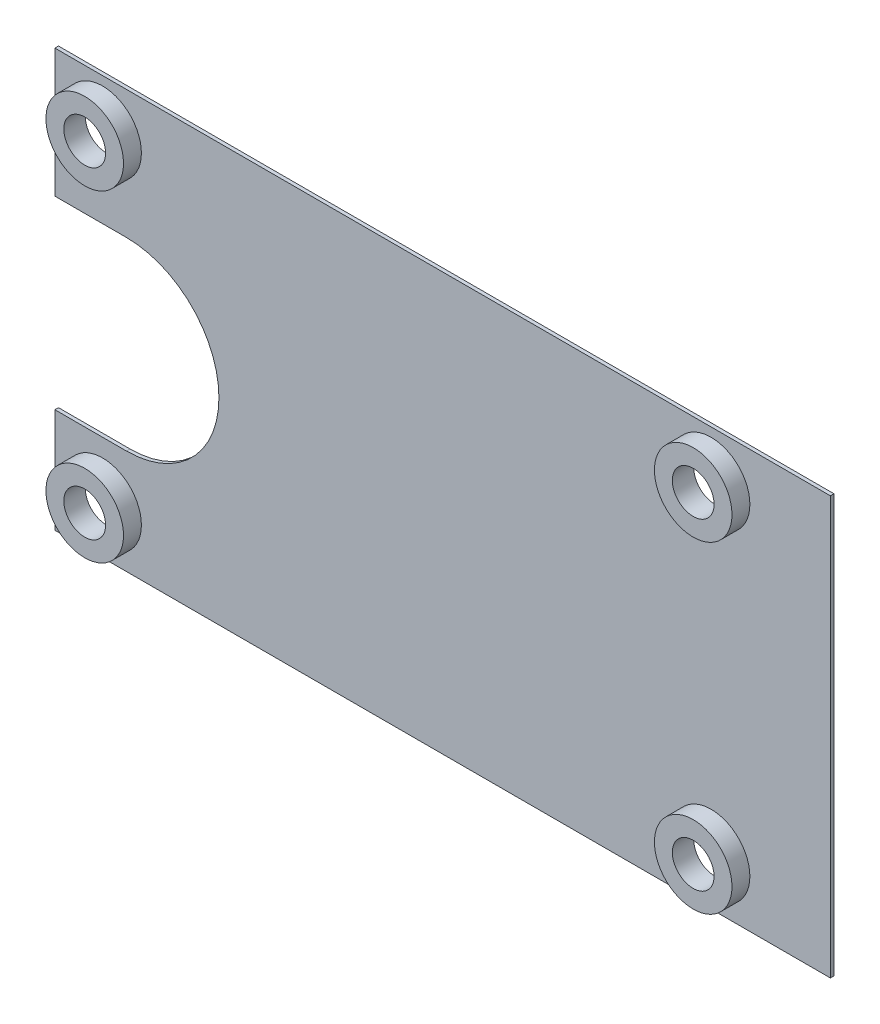
ISO-10303-21;
HEADER;
FILE_DESCRIPTION(('STEP AP214'),'2;1');
FILE_NAME('part.step','',(''),(''),'','','');
FILE_SCHEMA(('AUTOMOTIVE_DESIGN { 1 0 10303 214 1 1 1 1 }'));
ENDSEC;
DATA;
#1=APPLICATION_CONTEXT('core data for automotive mechanical design processes');
#2=APPLICATION_PROTOCOL_DEFINITION('international standard','automotive_design',2000,#1);
#3=PRODUCT_CONTEXT('',#1,'mechanical');
#4=PRODUCT('Part','Part','',(#3));
#5=PRODUCT_RELATED_PRODUCT_CATEGORY('part','',(#4));
#6=PRODUCT_DEFINITION_FORMATION('','',#4);
#7=PRODUCT_DEFINITION_CONTEXT('part definition',#1,'design');
#8=PRODUCT_DEFINITION('design','',#6,#7);
#9=PRODUCT_DEFINITION_SHAPE('','',#8);
#10=(LENGTH_UNIT() NAMED_UNIT(*) SI_UNIT(.MILLI.,.METRE.));
#11=(NAMED_UNIT(*) PLANE_ANGLE_UNIT() SI_UNIT($,.RADIAN.));
#12=(NAMED_UNIT(*) SI_UNIT($,.STERADIAN.) SOLID_ANGLE_UNIT());
#13=UNCERTAINTY_MEASURE_WITH_UNIT(LENGTH_MEASURE(1.E-05),#10,'distance_accuracy_value','');
#14=(GEOMETRIC_REPRESENTATION_CONTEXT(3) GLOBAL_UNCERTAINTY_ASSIGNED_CONTEXT((#13)) GLOBAL_UNIT_ASSIGNED_CONTEXT((#10,
#11,#12)) REPRESENTATION_CONTEXT('',''));
#15=CARTESIAN_POINT('',(0.,0.,0.));
#16=DIRECTION('',(0.,0.,1.));
#17=DIRECTION('',(1.,0.,0.));
#18=AXIS2_PLACEMENT_3D('',#15,#16,#17);
#19=CARTESIAN_POINT('',(-32.5,17.5,0.3));
#20=DIRECTION('',(1.,0.,0.));
#21=DIRECTION('',(0.,0.,-1.));
#22=AXIS2_PLACEMENT_3D('',#19,#20,#21);
#23=PLANE('',#22);
#24=DIRECTION('',(0.,-1.,0.));
#25=VECTOR('',#24,1.);
#26=CARTESIAN_POINT('',(-32.5,17.5,0.));
#27=LINE('',#26,#25);
#28=CARTESIAN_POINT('',(-32.5,17.5,0.));
#29=VERTEX_POINT('',#28);
#30=CARTESIAN_POINT('',(-32.5,6.75,0.));
#31=VERTEX_POINT('',#30);
#32=EDGE_CURVE('E148',#29,#31,#27,.T.);
#33=ORIENTED_EDGE('',*,*,#32,.T.);
#34=DIRECTION('',(0.,0.,1.));
#35=VECTOR('',#34,1.);
#36=CARTESIAN_POINT('',(-32.5,6.75,-9.7));
#37=LINE('',#36,#35);
#38=CARTESIAN_POINT('',(-32.5,6.75,0.3));
#39=VERTEX_POINT('',#38);
#40=EDGE_CURVE('E180',#31,#39,#37,.T.);
#41=ORIENTED_EDGE('',*,*,#40,.T.);
#42=DIRECTION('',(0.,-1.,0.));
#43=VECTOR('',#42,1.);
#44=CARTESIAN_POINT('',(-32.5,17.5,0.3));
#45=LINE('',#44,#43);
#46=CARTESIAN_POINT('',(-32.5,17.5,0.3));
#47=VERTEX_POINT('',#46);
#48=EDGE_CURVE('E132',#47,#39,#45,.T.);
#49=ORIENTED_EDGE('',*,*,#48,.F.);
#50=DIRECTION('',(0.,0.,-1.));
#51=VECTOR('',#50,1.);
#52=CARTESIAN_POINT('',(-32.5,17.5,0.3));
#53=LINE('',#52,#51);
#54=EDGE_CURVE('E154',#47,#29,#53,.T.);
#55=ORIENTED_EDGE('',*,*,#54,.T.);
#56=EDGE_LOOP('',(#33,#41,#49,#55));
#57=FACE_BOUND('',#56,.T.);
#58=ADVANCED_FACE('F37',(#57),#23,.F.);
#59=CARTESIAN_POINT('',(0.,0.,0.3));
#60=DIRECTION('',(0.,0.,1.));
#61=DIRECTION('',(1.,0.,0.));
#62=AXIS2_PLACEMENT_3D('',#59,#60,#61);
#63=PLANE('',#62);
#64=DIRECTION('',(-1.,0.,0.));
#65=VECTOR('',#64,1.);
#66=CARTESIAN_POINT('',(-32.5,6.75,0.3));
#67=LINE('',#66,#65);
#68=CARTESIAN_POINT('',(-26.5,6.75,0.3));
#69=VERTEX_POINT('',#68);
#70=EDGE_CURVE('E120',#69,#39,#67,.T.);
#71=ORIENTED_EDGE('',*,*,#70,.F.);
#72=CARTESIAN_POINT('',(-26.5,-0.999999999999997,0.3));
#73=DIRECTION('',(0.,0.,1.));
#74=DIRECTION('',(1.,0.,0.));
#75=AXIS2_PLACEMENT_3D('',#72,#73,#74);
#76=CIRCLE('',#75,7.75);
#77=CARTESIAN_POINT('',(-26.5,-8.75,0.3));
#78=VERTEX_POINT('',#77);
#79=EDGE_CURVE('E128',#78,#69,#76,.T.);
#80=ORIENTED_EDGE('',*,*,#79,.F.);
#81=DIRECTION('',(1.,0.,0.));
#82=VECTOR('',#81,1.);
#83=CARTESIAN_POINT('',(-32.5,-8.75,0.3));
#84=LINE('',#83,#82);
#85=CARTESIAN_POINT('',(-32.5,-8.75,0.3));
#86=VERTEX_POINT('',#85);
#87=EDGE_CURVE('E113',#86,#78,#84,.T.);
#88=ORIENTED_EDGE('',*,*,#87,.F.);
#89=CARTESIAN_POINT('',(-32.5,-17.5,0.3));
#90=VERTEX_POINT('',#89);
#91=EDGE_CURVE('E125',#86,#90,#45,.T.);
#92=ORIENTED_EDGE('',*,*,#91,.T.);
#93=DIRECTION('',(1.,0.,0.));
#94=VECTOR('',#93,1.);
#95=CARTESIAN_POINT('',(-32.5,-17.5,0.3));
#96=LINE('',#95,#94);
#97=CARTESIAN_POINT('',(32.5,-17.5,0.3));
#98=VERTEX_POINT('',#97);
#99=EDGE_CURVE('E61',#90,#98,#96,.T.);
#100=ORIENTED_EDGE('',*,*,#99,.T.);
#101=DIRECTION('',(0.,1.,0.));
#102=VECTOR('',#101,1.);
#103=CARTESIAN_POINT('',(32.5,17.5,0.3));
#104=LINE('',#103,#102);
#105=CARTESIAN_POINT('',(32.5,17.5,0.3));
#106=VERTEX_POINT('',#105);
#107=EDGE_CURVE('E135',#98,#106,#104,.T.);
#108=ORIENTED_EDGE('',*,*,#107,.T.);
#109=DIRECTION('',(-1.,0.,0.));
#110=VECTOR('',#109,1.);
#111=CARTESIAN_POINT('',(-32.5,17.5,0.3));
#112=LINE('',#111,#110);
#113=EDGE_CURVE('E90',#106,#47,#112,.T.);
#114=ORIENTED_EDGE('',*,*,#113,.T.);
#115=ORIENTED_EDGE('',*,*,#48,.T.);
#116=EDGE_LOOP('',(#71,#80,#88,#92,#100,#108,#114,#115));
#117=FACE_BOUND('',#116,.T.);
#118=CARTESIAN_POINT('',(22.5,-13.5,0.3));
#119=DIRECTION('',(0.,0.,1.));
#120=DIRECTION('',(1.,0.,0.));
#121=AXIS2_PLACEMENT_3D('',#118,#119,#120);
#122=CIRCLE('',#121,3.25);
#123=CARTESIAN_POINT('',(25.75,-13.5,0.3));
#124=VERTEX_POINT('',#123);
#125=EDGE_CURVE('E197',#124,#124,#122,.T.);
#126=ORIENTED_EDGE('',*,*,#125,.F.);
#127=EDGE_LOOP('',(#126));
#128=FACE_BOUND('',#127,.T.);
#129=CARTESIAN_POINT('',(-28.5,13.5,0.3));
#130=DIRECTION('',(0.,0.,1.));
#131=DIRECTION('',(1.,0.,0.));
#132=AXIS2_PLACEMENT_3D('',#129,#130,#131);
#133=CIRCLE('',#132,3.25);
#134=CARTESIAN_POINT('',(-25.25,13.5,0.3));
#135=VERTEX_POINT('',#134);
#136=EDGE_CURVE('E217',#135,#135,#133,.T.);
#137=ORIENTED_EDGE('',*,*,#136,.F.);
#138=EDGE_LOOP('',(#137));
#139=FACE_BOUND('',#138,.T.);
#140=CARTESIAN_POINT('',(-28.5,-13.5,0.3));
#141=DIRECTION('',(0.,0.,1.));
#142=DIRECTION('',(1.,0.,0.));
#143=AXIS2_PLACEMENT_3D('',#140,#141,#142);
#144=CIRCLE('',#143,3.25);
#145=CARTESIAN_POINT('',(-25.25,-13.5,0.3));
#146=VERTEX_POINT('',#145);
#147=EDGE_CURVE('E206',#146,#146,#144,.T.);
#148=ORIENTED_EDGE('',*,*,#147,.F.);
#149=EDGE_LOOP('',(#148));
#150=FACE_BOUND('',#149,.T.);
#151=CARTESIAN_POINT('',(22.5,13.5,0.3));
#152=DIRECTION('',(0.,0.,1.));
#153=DIRECTION('',(1.,0.,0.));
#154=AXIS2_PLACEMENT_3D('',#151,#152,#153);
#155=CIRCLE('',#154,3.25);
#156=CARTESIAN_POINT('',(25.75,13.5,0.3));
#157=VERTEX_POINT('',#156);
#158=EDGE_CURVE('E188',#157,#157,#155,.T.);
#159=ORIENTED_EDGE('',*,*,#158,.F.);
#160=EDGE_LOOP('',(#159));
#161=FACE_BOUND('',#160,.T.);
#162=ADVANCED_FACE('F123',(#117,#128,#139,#150,#161),#63,.T.);
#163=CARTESIAN_POINT('',(32.5,17.5,0.3));
#164=DIRECTION('',(-1.,0.,0.));
#165=DIRECTION('',(0.,-1.,0.));
#166=AXIS2_PLACEMENT_3D('',#163,#164,#165);
#167=PLANE('',#166);
#168=DIRECTION('',(0.,1.,0.));
#169=VECTOR('',#168,1.);
#170=CARTESIAN_POINT('',(32.5,17.5,0.));
#171=LINE('',#170,#169);
#172=CARTESIAN_POINT('',(32.5,-17.5,0.));
#173=VERTEX_POINT('',#172);
#174=CARTESIAN_POINT('',(32.5,17.5,0.));
#175=VERTEX_POINT('',#174);
#176=EDGE_CURVE('E141',#173,#175,#171,.T.);
#177=ORIENTED_EDGE('',*,*,#176,.T.);
#178=DIRECTION('',(0.,0.,-1.));
#179=VECTOR('',#178,1.);
#180=CARTESIAN_POINT('',(32.5,17.5,0.3));
#181=LINE('',#180,#179);
#182=EDGE_CURVE('E157',#106,#175,#181,.T.);
#183=ORIENTED_EDGE('',*,*,#182,.F.);
#184=ORIENTED_EDGE('',*,*,#107,.F.);
#185=DIRECTION('',(0.,0.,-1.));
#186=VECTOR('',#185,1.);
#187=CARTESIAN_POINT('',(32.5,-17.5,0.3));
#188=LINE('',#187,#186);
#189=EDGE_CURVE('E140',#98,#173,#188,.T.);
#190=ORIENTED_EDGE('',*,*,#189,.T.);
#191=EDGE_LOOP('',(#177,#183,#184,#190));
#192=FACE_BOUND('',#191,.T.);
#193=ADVANCED_FACE('F39',(#192),#167,.F.);
#194=CARTESIAN_POINT('',(-32.5,17.5,0.3));
#195=DIRECTION('',(0.,-1.,0.));
#196=DIRECTION('',(0.,0.,-1.));
#197=AXIS2_PLACEMENT_3D('',#194,#195,#196);
#198=PLANE('',#197);
#199=DIRECTION('',(-1.,0.,0.));
#200=VECTOR('',#199,1.);
#201=CARTESIAN_POINT('',(-32.5,17.5,0.));
#202=LINE('',#201,#200);
#203=EDGE_CURVE('E144',#175,#29,#202,.T.);
#204=ORIENTED_EDGE('',*,*,#203,.T.);
#205=ORIENTED_EDGE('',*,*,#54,.F.);
#206=ORIENTED_EDGE('',*,*,#113,.F.);
#207=ORIENTED_EDGE('',*,*,#182,.T.);
#208=EDGE_LOOP('',(#204,#205,#206,#207));
#209=FACE_BOUND('',#208,.T.);
#210=ADVANCED_FACE('F225',(#209),#198,.F.);
#211=ORIENTED_EDGE('',*,*,#91,.F.);
#212=DIRECTION('',(0.,0.,1.));
#213=VECTOR('',#212,1.);
#214=CARTESIAN_POINT('',(-32.5,-8.75,-9.7));
#215=LINE('',#214,#213);
#216=CARTESIAN_POINT('',(-32.5,-8.75,0.));
#217=VERTEX_POINT('',#216);
#218=EDGE_CURVE('E110',#217,#86,#215,.T.);
#219=ORIENTED_EDGE('',*,*,#218,.F.);
#220=CARTESIAN_POINT('',(-32.5,-17.5,0.));
#221=VERTEX_POINT('',#220);
#222=EDGE_CURVE('E147',#217,#221,#27,.T.);
#223=ORIENTED_EDGE('',*,*,#222,.T.);
#224=DIRECTION('',(0.,0.,-1.));
#225=VECTOR('',#224,1.);
#226=CARTESIAN_POINT('',(-32.5,-17.5,0.3));
#227=LINE('',#226,#225);
#228=EDGE_CURVE('E131',#90,#221,#227,.T.);
#229=ORIENTED_EDGE('',*,*,#228,.F.);
#230=EDGE_LOOP('',(#211,#219,#223,#229));
#231=FACE_BOUND('',#230,.T.);
#232=ADVANCED_FACE('F130',(#231),#23,.F.);
#233=CARTESIAN_POINT('',(-32.5,-17.5,0.3));
#234=DIRECTION('',(0.,1.,0.));
#235=DIRECTION('',(0.,0.,1.));
#236=AXIS2_PLACEMENT_3D('',#233,#234,#235);
#237=PLANE('',#236);
#238=DIRECTION('',(1.,0.,0.));
#239=VECTOR('',#238,1.);
#240=CARTESIAN_POINT('',(-32.5,-17.5,0.));
#241=LINE('',#240,#239);
#242=EDGE_CURVE('E82',#221,#173,#241,.T.);
#243=ORIENTED_EDGE('',*,*,#242,.T.);
#244=ORIENTED_EDGE('',*,*,#189,.F.);
#245=ORIENTED_EDGE('',*,*,#99,.F.);
#246=ORIENTED_EDGE('',*,*,#228,.T.);
#247=EDGE_LOOP('',(#243,#244,#245,#246));
#248=FACE_BOUND('',#247,.T.);
#249=ADVANCED_FACE('F251',(#248),#237,.F.);
#250=CARTESIAN_POINT('',(0.,0.,0.));
#251=DIRECTION('',(0.,0.,1.));
#252=DIRECTION('',(1.,0.,0.));
#253=AXIS2_PLACEMENT_3D('',#250,#251,#252);
#254=PLANE('',#253);
#255=CARTESIAN_POINT('',(-28.5,-13.5,0.));
#256=DIRECTION('',(0.,0.,1.));
#257=DIRECTION('',(1.,0.,0.));
#258=AXIS2_PLACEMENT_3D('',#255,#256,#257);
#259=CIRCLE('',#258,1.75);
#260=CARTESIAN_POINT('',(-26.75,-13.5,0.));
#261=VERTEX_POINT('',#260);
#262=EDGE_CURVE('E145',#261,#261,#259,.T.);
#263=ORIENTED_EDGE('',*,*,#262,.T.);
#264=EDGE_LOOP('',(#263));
#265=FACE_BOUND('',#264,.T.);
#266=CARTESIAN_POINT('',(22.5,13.5,0.));
#267=DIRECTION('',(0.,0.,1.));
#268=DIRECTION('',(1.,0.,0.));
#269=AXIS2_PLACEMENT_3D('',#266,#267,#268);
#270=CIRCLE('',#269,1.75);
#271=CARTESIAN_POINT('',(24.25,13.5,0.));
#272=VERTEX_POINT('',#271);
#273=EDGE_CURVE('E166',#272,#272,#270,.T.);
#274=ORIENTED_EDGE('',*,*,#273,.T.);
#275=EDGE_LOOP('',(#274));
#276=FACE_BOUND('',#275,.T.);
#277=CARTESIAN_POINT('',(22.5,-13.5,0.));
#278=DIRECTION('',(0.,0.,1.));
#279=DIRECTION('',(1.,0.,0.));
#280=AXIS2_PLACEMENT_3D('',#277,#278,#279);
#281=CIRCLE('',#280,1.75);
#282=CARTESIAN_POINT('',(24.25,-13.5,0.));
#283=VERTEX_POINT('',#282);
#284=EDGE_CURVE('E162',#283,#283,#281,.T.);
#285=ORIENTED_EDGE('',*,*,#284,.T.);
#286=EDGE_LOOP('',(#285));
#287=FACE_BOUND('',#286,.T.);
#288=CARTESIAN_POINT('',(-28.5,13.5,0.));
#289=DIRECTION('',(0.,0.,1.));
#290=DIRECTION('',(1.,0.,0.));
#291=AXIS2_PLACEMENT_3D('',#288,#289,#290);
#292=CIRCLE('',#291,1.75);
#293=CARTESIAN_POINT('',(-26.75,13.5,0.));
#294=VERTEX_POINT('',#293);
#295=EDGE_CURVE('E159',#294,#294,#292,.T.);
#296=ORIENTED_EDGE('',*,*,#295,.T.);
#297=EDGE_LOOP('',(#296));
#298=FACE_BOUND('',#297,.T.);
#299=CARTESIAN_POINT('',(-26.5,-0.999999999999997,0.));
#300=DIRECTION('',(0.,0.,1.));
#301=DIRECTION('',(1.,0.,0.));
#302=AXIS2_PLACEMENT_3D('',#299,#300,#301);
#303=CIRCLE('',#302,7.75);
#304=CARTESIAN_POINT('',(-26.5,-8.75,0.));
#305=VERTEX_POINT('',#304);
#306=CARTESIAN_POINT('',(-26.5,6.75,0.));
#307=VERTEX_POINT('',#306);
#308=EDGE_CURVE('E45',#305,#307,#303,.T.);
#309=ORIENTED_EDGE('',*,*,#308,.T.);
#310=DIRECTION('',(-1.,0.,0.));
#311=VECTOR('',#310,1.);
#312=CARTESIAN_POINT('',(0.,6.75,0.));
#313=LINE('',#312,#311);
#314=EDGE_CURVE('E11',#307,#31,#313,.T.);
#315=ORIENTED_EDGE('',*,*,#314,.T.);
#316=ORIENTED_EDGE('',*,*,#32,.F.);
#317=ORIENTED_EDGE('',*,*,#203,.F.);
#318=ORIENTED_EDGE('',*,*,#176,.F.);
#319=ORIENTED_EDGE('',*,*,#242,.F.);
#320=ORIENTED_EDGE('',*,*,#222,.F.);
#321=DIRECTION('',(1.,0.,0.));
#322=VECTOR('',#321,1.);
#323=CARTESIAN_POINT('',(0.,-8.75,0.));
#324=LINE('',#323,#322);
#325=EDGE_CURVE('E116',#217,#305,#324,.T.);
#326=ORIENTED_EDGE('',*,*,#325,.T.);
#327=EDGE_LOOP('',(#309,#315,#316,#317,#318,#319,#320,#326));
#328=FACE_BOUND('',#327,.T.);
#329=ADVANCED_FACE('F173',(#265,#276,#287,#298,#328),#254,.F.);
#330=CARTESIAN_POINT('',(-28.5,13.5,-1.3));
#331=DIRECTION('',(0.,0.,1.));
#332=DIRECTION('',(1.,0.,0.));
#333=AXIS2_PLACEMENT_3D('',#330,#331,#332);
#334=CYLINDRICAL_SURFACE('',#333,1.75);
#335=ORIENTED_EDGE('',*,*,#295,.F.);
#336=EDGE_LOOP('',(#335));
#337=FACE_BOUND('',#336,.T.);
#338=CARTESIAN_POINT('',(-28.5,13.5,1.8));
#339=DIRECTION('',(0.,0.,1.));
#340=DIRECTION('',(1.,0.,0.));
#341=AXIS2_PLACEMENT_3D('',#338,#339,#340);
#342=CIRCLE('',#341,1.75);
#343=CARTESIAN_POINT('',(-26.75,13.5,1.8));
#344=VERTEX_POINT('',#343);
#345=EDGE_CURVE('E214',#344,#344,#342,.T.);
#346=ORIENTED_EDGE('',*,*,#345,.T.);
#347=EDGE_LOOP('',(#346));
#348=FACE_BOUND('',#347,.T.);
#349=ADVANCED_FACE('F281',(#337,#348),#334,.F.);
#350=CARTESIAN_POINT('',(22.5,-13.5,-1.3));
#351=DIRECTION('',(0.,0.,1.));
#352=DIRECTION('',(1.,0.,0.));
#353=AXIS2_PLACEMENT_3D('',#350,#351,#352);
#354=CYLINDRICAL_SURFACE('',#353,1.75);
#355=ORIENTED_EDGE('',*,*,#284,.F.);
#356=EDGE_LOOP('',(#355));
#357=FACE_BOUND('',#356,.T.);
#358=CARTESIAN_POINT('',(22.5,-13.5,1.8));
#359=DIRECTION('',(0.,0.,1.));
#360=DIRECTION('',(1.,0.,0.));
#361=AXIS2_PLACEMENT_3D('',#358,#359,#360);
#362=CIRCLE('',#361,1.75);
#363=CARTESIAN_POINT('',(24.25,-13.5,1.8));
#364=VERTEX_POINT('',#363);
#365=EDGE_CURVE('E200',#364,#364,#362,.T.);
#366=ORIENTED_EDGE('',*,*,#365,.T.);
#367=EDGE_LOOP('',(#366));
#368=FACE_BOUND('',#367,.T.);
#369=ADVANCED_FACE('F288',(#357,#368),#354,.F.);
#370=CARTESIAN_POINT('',(22.5,13.5,-1.3));
#371=DIRECTION('',(0.,0.,1.));
#372=DIRECTION('',(1.,0.,0.));
#373=AXIS2_PLACEMENT_3D('',#370,#371,#372);
#374=CYLINDRICAL_SURFACE('',#373,1.75);
#375=ORIENTED_EDGE('',*,*,#273,.F.);
#376=EDGE_LOOP('',(#375));
#377=FACE_BOUND('',#376,.T.);
#378=CARTESIAN_POINT('',(22.5,13.5,1.8));
#379=DIRECTION('',(0.,0.,1.));
#380=DIRECTION('',(1.,0.,0.));
#381=AXIS2_PLACEMENT_3D('',#378,#379,#380);
#382=CIRCLE('',#381,1.75);
#383=CARTESIAN_POINT('',(24.25,13.5,1.8));
#384=VERTEX_POINT('',#383);
#385=EDGE_CURVE('E191',#384,#384,#382,.T.);
#386=ORIENTED_EDGE('',*,*,#385,.T.);
#387=EDGE_LOOP('',(#386));
#388=FACE_BOUND('',#387,.T.);
#389=ADVANCED_FACE('F303',(#377,#388),#374,.F.);
#390=CARTESIAN_POINT('',(-28.5,-13.5,-1.3));
#391=DIRECTION('',(0.,0.,1.));
#392=DIRECTION('',(1.,0.,0.));
#393=AXIS2_PLACEMENT_3D('',#390,#391,#392);
#394=CYLINDRICAL_SURFACE('',#393,1.75);
#395=ORIENTED_EDGE('',*,*,#262,.F.);
#396=EDGE_LOOP('',(#395));
#397=FACE_BOUND('',#396,.T.);
#398=CARTESIAN_POINT('',(-28.5,-13.5,1.8));
#399=DIRECTION('',(0.,0.,1.));
#400=DIRECTION('',(1.,0.,0.));
#401=AXIS2_PLACEMENT_3D('',#398,#399,#400);
#402=CIRCLE('',#401,1.75);
#403=CARTESIAN_POINT('',(-26.75,-13.5,1.8));
#404=VERTEX_POINT('',#403);
#405=EDGE_CURVE('E209',#404,#404,#402,.T.);
#406=ORIENTED_EDGE('',*,*,#405,.T.);
#407=EDGE_LOOP('',(#406));
#408=FACE_BOUND('',#407,.T.);
#409=ADVANCED_FACE('F276',(#397,#408),#394,.F.);
#410=CARTESIAN_POINT('',(-28.5,13.5,1.8));
#411=DIRECTION('',(0.,0.,1.));
#412=DIRECTION('',(1.,0.,0.));
#413=AXIS2_PLACEMENT_3D('',#410,#411,#412);
#414=PLANE('',#413);
#415=CARTESIAN_POINT('',(-28.5,13.5,1.8));
#416=DIRECTION('',(0.,0.,1.));
#417=DIRECTION('',(1.,0.,0.));
#418=AXIS2_PLACEMENT_3D('',#415,#416,#417);
#419=CIRCLE('',#418,3.25);
#420=CARTESIAN_POINT('',(-25.25,13.5,1.8));
#421=VERTEX_POINT('',#420);
#422=EDGE_CURVE('E163',#421,#421,#419,.T.);
#423=ORIENTED_EDGE('',*,*,#422,.T.);
#424=EDGE_LOOP('',(#423));
#425=FACE_BOUND('',#424,.T.);
#426=ORIENTED_EDGE('',*,*,#345,.F.);
#427=EDGE_LOOP('',(#426));
#428=FACE_BOUND('',#427,.T.);
#429=ADVANCED_FACE('F325',(#425,#428),#414,.T.);
#430=CARTESIAN_POINT('',(-28.5,13.5,1.8));
#431=DIRECTION('',(0.,0.,-1.));
#432=DIRECTION('',(-1.,0.,0.));
#433=AXIS2_PLACEMENT_3D('',#430,#431,#432);
#434=CYLINDRICAL_SURFACE('',#433,3.25);
#435=ORIENTED_EDGE('',*,*,#422,.F.);
#436=EDGE_LOOP('',(#435));
#437=FACE_BOUND('',#436,.T.);
#438=ORIENTED_EDGE('',*,*,#136,.T.);
#439=EDGE_LOOP('',(#438));
#440=FACE_BOUND('',#439,.T.);
#441=ADVANCED_FACE('F334',(#437,#440),#434,.T.);
#442=CARTESIAN_POINT('',(-28.5,-13.5,1.8));
#443=DIRECTION('',(0.,0.,1.));
#444=DIRECTION('',(1.,0.,0.));
#445=AXIS2_PLACEMENT_3D('',#442,#443,#444);
#446=PLANE('',#445);
#447=CARTESIAN_POINT('',(-28.5,-13.5,1.8));
#448=DIRECTION('',(0.,0.,1.));
#449=DIRECTION('',(1.,0.,0.));
#450=AXIS2_PLACEMENT_3D('',#447,#448,#449);
#451=CIRCLE('',#450,3.25);
#452=CARTESIAN_POINT('',(-25.25,-13.5,1.8));
#453=VERTEX_POINT('',#452);
#454=EDGE_CURVE('E205',#453,#453,#451,.T.);
#455=ORIENTED_EDGE('',*,*,#454,.T.);
#456=EDGE_LOOP('',(#455));
#457=FACE_BOUND('',#456,.T.);
#458=ORIENTED_EDGE('',*,*,#405,.F.);
#459=EDGE_LOOP('',(#458));
#460=FACE_BOUND('',#459,.T.);
#461=ADVANCED_FACE('F345',(#457,#460),#446,.T.);
#462=CARTESIAN_POINT('',(-28.5,-13.5,1.8));
#463=DIRECTION('',(0.,0.,-1.));
#464=DIRECTION('',(-1.,0.,0.));
#465=AXIS2_PLACEMENT_3D('',#462,#463,#464);
#466=CYLINDRICAL_SURFACE('',#465,3.25);
#467=ORIENTED_EDGE('',*,*,#454,.F.);
#468=EDGE_LOOP('',(#467));
#469=FACE_BOUND('',#468,.T.);
#470=ORIENTED_EDGE('',*,*,#147,.T.);
#471=EDGE_LOOP('',(#470));
#472=FACE_BOUND('',#471,.T.);
#473=ADVANCED_FACE('F356',(#469,#472),#466,.T.);
#474=CARTESIAN_POINT('',(22.5,-13.5,1.8));
#475=DIRECTION('',(0.,0.,1.));
#476=DIRECTION('',(1.,0.,0.));
#477=AXIS2_PLACEMENT_3D('',#474,#475,#476);
#478=PLANE('',#477);
#479=CARTESIAN_POINT('',(22.5,-13.5,1.8));
#480=DIRECTION('',(0.,0.,1.));
#481=DIRECTION('',(1.,0.,0.));
#482=AXIS2_PLACEMENT_3D('',#479,#480,#481);
#483=CIRCLE('',#482,3.25);
#484=CARTESIAN_POINT('',(25.75,-13.5,1.8));
#485=VERTEX_POINT('',#484);
#486=EDGE_CURVE('E196',#485,#485,#483,.T.);
#487=ORIENTED_EDGE('',*,*,#486,.T.);
#488=EDGE_LOOP('',(#487));
#489=FACE_BOUND('',#488,.T.);
#490=ORIENTED_EDGE('',*,*,#365,.F.);
#491=EDGE_LOOP('',(#490));
#492=FACE_BOUND('',#491,.T.);
#493=ADVANCED_FACE('F367',(#489,#492),#478,.T.);
#494=CARTESIAN_POINT('',(22.5,-13.5,1.8));
#495=DIRECTION('',(0.,0.,-1.));
#496=DIRECTION('',(-1.,0.,0.));
#497=AXIS2_PLACEMENT_3D('',#494,#495,#496);
#498=CYLINDRICAL_SURFACE('',#497,3.25);
#499=ORIENTED_EDGE('',*,*,#486,.F.);
#500=EDGE_LOOP('',(#499));
#501=FACE_BOUND('',#500,.T.);
#502=ORIENTED_EDGE('',*,*,#125,.T.);
#503=EDGE_LOOP('',(#502));
#504=FACE_BOUND('',#503,.T.);
#505=ADVANCED_FACE('F378',(#501,#504),#498,.T.);
#506=CARTESIAN_POINT('',(22.5,13.5,1.8));
#507=DIRECTION('',(0.,0.,1.));
#508=DIRECTION('',(1.,0.,0.));
#509=AXIS2_PLACEMENT_3D('',#506,#507,#508);
#510=PLANE('',#509);
#511=CARTESIAN_POINT('',(22.5,13.5,1.8));
#512=DIRECTION('',(0.,0.,1.));
#513=DIRECTION('',(1.,0.,0.));
#514=AXIS2_PLACEMENT_3D('',#511,#512,#513);
#515=CIRCLE('',#514,3.25);
#516=CARTESIAN_POINT('',(25.75,13.5,1.8));
#517=VERTEX_POINT('',#516);
#518=EDGE_CURVE('E183',#517,#517,#515,.T.);
#519=ORIENTED_EDGE('',*,*,#518,.T.);
#520=EDGE_LOOP('',(#519));
#521=FACE_BOUND('',#520,.T.);
#522=ORIENTED_EDGE('',*,*,#385,.F.);
#523=EDGE_LOOP('',(#522));
#524=FACE_BOUND('',#523,.T.);
#525=ADVANCED_FACE('F239',(#521,#524),#510,.T.);
#526=CARTESIAN_POINT('',(22.5,13.5,1.8));
#527=DIRECTION('',(0.,0.,-1.));
#528=DIRECTION('',(-1.,0.,0.));
#529=AXIS2_PLACEMENT_3D('',#526,#527,#528);
#530=CYLINDRICAL_SURFACE('',#529,3.25);
#531=ORIENTED_EDGE('',*,*,#518,.F.);
#532=EDGE_LOOP('',(#531));
#533=FACE_BOUND('',#532,.T.);
#534=ORIENTED_EDGE('',*,*,#158,.T.);
#535=EDGE_LOOP('',(#534));
#536=FACE_BOUND('',#535,.T.);
#537=ADVANCED_FACE('F231',(#533,#536),#530,.T.);
#538=CARTESIAN_POINT('',(-32.5,6.75,-9.7));
#539=DIRECTION('',(0.,1.,0.));
#540=DIRECTION('',(0.,0.,1.));
#541=AXIS2_PLACEMENT_3D('',#538,#539,#540);
#542=PLANE('',#541);
#543=DIRECTION('',(0.,0.,1.));
#544=VECTOR('',#543,1.);
#545=CARTESIAN_POINT('',(-26.5,6.75,-9.7));
#546=LINE('',#545,#544);
#547=EDGE_CURVE('E178',#307,#69,#546,.T.);
#548=ORIENTED_EDGE('',*,*,#547,.T.);
#549=ORIENTED_EDGE('',*,*,#70,.T.);
#550=ORIENTED_EDGE('',*,*,#40,.F.);
#551=ORIENTED_EDGE('',*,*,#314,.F.);
#552=EDGE_LOOP('',(#548,#549,#550,#551));
#553=FACE_BOUND('',#552,.T.);
#554=ADVANCED_FACE('F229',(#553),#542,.F.);
#555=CARTESIAN_POINT('',(-26.5,-0.999999999999997,-9.7));
#556=DIRECTION('',(0.,0.,1.));
#557=DIRECTION('',(1.,0.,0.));
#558=AXIS2_PLACEMENT_3D('',#555,#556,#557);
#559=CYLINDRICAL_SURFACE('',#558,7.75);
#560=DIRECTION('',(0.,0.,1.));
#561=VECTOR('',#560,1.);
#562=CARTESIAN_POINT('',(-26.5,-8.75,-9.7));
#563=LINE('',#562,#561);
#564=EDGE_CURVE('E52',#305,#78,#563,.T.);
#565=ORIENTED_EDGE('',*,*,#564,.T.);
#566=ORIENTED_EDGE('',*,*,#79,.T.);
#567=ORIENTED_EDGE('',*,*,#547,.F.);
#568=ORIENTED_EDGE('',*,*,#308,.F.);
#569=EDGE_LOOP('',(#565,#566,#567,#568));
#570=FACE_BOUND('',#569,.T.);
#571=ADVANCED_FACE('F177',(#570),#559,.F.);
#572=CARTESIAN_POINT('',(-32.5,-8.75,-9.7));
#573=DIRECTION('',(0.,-1.,0.));
#574=DIRECTION('',(0.,0.,-1.));
#575=AXIS2_PLACEMENT_3D('',#572,#573,#574);
#576=PLANE('',#575);
#577=ORIENTED_EDGE('',*,*,#218,.T.);
#578=ORIENTED_EDGE('',*,*,#87,.T.);
#579=ORIENTED_EDGE('',*,*,#564,.F.);
#580=ORIENTED_EDGE('',*,*,#325,.F.);
#581=EDGE_LOOP('',(#577,#578,#579,#580));
#582=FACE_BOUND('',#581,.T.);
#583=ADVANCED_FACE('F112',(#582),#576,.F.);
#584=CLOSED_SHELL('',(#58,#162,#193,#210,#232,#249,#329,#349,#369,#389,#409,#429,#441,#461,#473,
#493,#505,#525,#537,#554,#571,#583));
#585=MANIFOLD_SOLID_BREP('B2',#584);
#586=ADVANCED_BREP_SHAPE_REPRESENTATION('',(#18,#585),#14);
#587=SHAPE_DEFINITION_REPRESENTATION(#9,#586);
ENDSEC;
END-ISO-10303-21;
